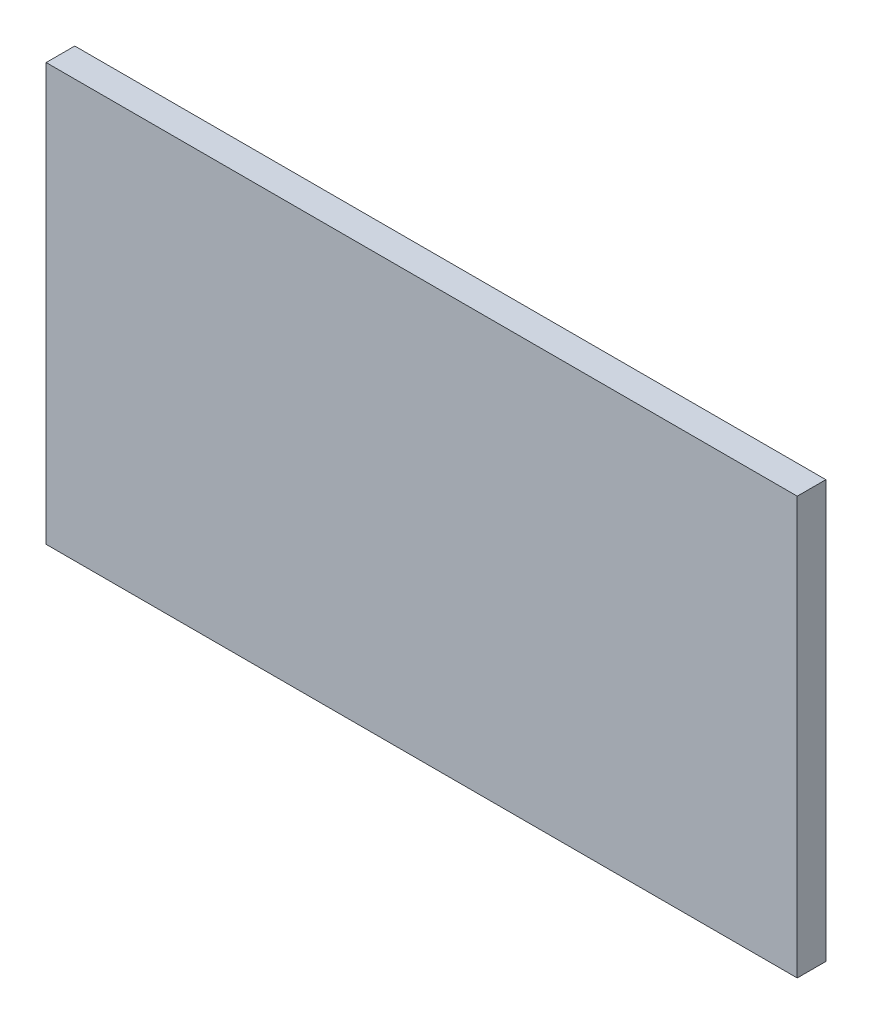
ISO-10303-21;
HEADER;
FILE_DESCRIPTION(('STEP AP214'),'2;1');
FILE_NAME('part.step','',(''),(''),'','','');
FILE_SCHEMA(('AUTOMOTIVE_DESIGN { 1 0 10303 214 1 1 1 1 }'));
ENDSEC;
DATA;
#1=APPLICATION_CONTEXT('core data for automotive mechanical design processes');
#2=APPLICATION_PROTOCOL_DEFINITION('international standard','automotive_design',2000,#1);
#3=PRODUCT_CONTEXT('',#1,'mechanical');
#4=PRODUCT('Part','Part','',(#3));
#5=PRODUCT_RELATED_PRODUCT_CATEGORY('part','',(#4));
#6=PRODUCT_DEFINITION_FORMATION('','',#4);
#7=PRODUCT_DEFINITION_CONTEXT('part definition',#1,'design');
#8=PRODUCT_DEFINITION('design','',#6,#7);
#9=PRODUCT_DEFINITION_SHAPE('','',#8);
#10=(LENGTH_UNIT() NAMED_UNIT(*) SI_UNIT(.MILLI.,.METRE.));
#11=(NAMED_UNIT(*) PLANE_ANGLE_UNIT() SI_UNIT($,.RADIAN.));
#12=(NAMED_UNIT(*) SI_UNIT($,.STERADIAN.) SOLID_ANGLE_UNIT());
#13=UNCERTAINTY_MEASURE_WITH_UNIT(LENGTH_MEASURE(1.E-05),#10,'distance_accuracy_value','');
#14=(GEOMETRIC_REPRESENTATION_CONTEXT(3) GLOBAL_UNCERTAINTY_ASSIGNED_CONTEXT((#13)) GLOBAL_UNIT_ASSIGNED_CONTEXT((#10,
#11,#12)) REPRESENTATION_CONTEXT('',''));
#15=CARTESIAN_POINT('',(0.,0.,0.));
#16=DIRECTION('',(0.,0.,1.));
#17=DIRECTION('',(1.,0.,0.));
#18=AXIS2_PLACEMENT_3D('',#15,#16,#17);
#19=CARTESIAN_POINT('',(12.50008,4.8,0.));
#20=DIRECTION('',(0.,0.,-1.));
#21=DIRECTION('',(-1.,0.,0.));
#22=AXIS2_PLACEMENT_3D('',#19,#20,#21);
#23=PLANE('',#22);
#24=DIRECTION('',(1.,0.,0.));
#25=VECTOR('',#24,1.);
#26=CARTESIAN_POINT('',(12.05008,5.05,0.));
#27=LINE('',#26,#25);
#28=CARTESIAN_POINT('',(12.05008,5.05,0.));
#29=VERTEX_POINT('',#28);
#30=CARTESIAN_POINT('',(12.95008,5.05,0.));
#31=VERTEX_POINT('',#30);
#32=EDGE_CURVE('E55',#29,#31,#27,.T.);
#33=ORIENTED_EDGE('',*,*,#32,.T.);
#34=DIRECTION('',(0.,1.,0.));
#35=VECTOR('',#34,1.);
#36=CARTESIAN_POINT('',(12.95008,5.05,0.));
#37=LINE('',#36,#35);
#38=CARTESIAN_POINT('',(12.95008,4.55,0.));
#39=VERTEX_POINT('',#38);
#40=EDGE_CURVE('E57',#31,#39,#37,.F.);
#41=ORIENTED_EDGE('',*,*,#40,.T.);
#42=DIRECTION('',(1.,0.,0.));
#43=VECTOR('',#42,1.);
#44=CARTESIAN_POINT('',(12.95008,4.55,0.));
#45=LINE('',#44,#43);
#46=CARTESIAN_POINT('',(12.05008,4.55,0.));
#47=VERTEX_POINT('',#46);
#48=EDGE_CURVE('E20',#39,#47,#45,.F.);
#49=ORIENTED_EDGE('',*,*,#48,.T.);
#50=DIRECTION('',(0.,1.,0.));
#51=VECTOR('',#50,1.);
#52=CARTESIAN_POINT('',(12.05008,4.55,0.));
#53=LINE('',#52,#51);
#54=EDGE_CURVE('E80',#47,#29,#53,.T.);
#55=ORIENTED_EDGE('',*,*,#54,.T.);
#56=EDGE_LOOP('',(#33,#41,#49,#55));
#57=FACE_BOUND('',#56,.T.);
#58=ADVANCED_FACE('F17',(#57),#23,.T.);
#59=CARTESIAN_POINT('',(12.95008,4.55,0.));
#60=DIRECTION('',(0.,1.,0.));
#61=DIRECTION('',(0.,0.,1.));
#62=AXIS2_PLACEMENT_3D('',#59,#60,#61);
#63=PLANE('',#62);
#64=DIRECTION('',(0.,0.,-1.));
#65=VECTOR('',#64,1.);
#66=CARTESIAN_POINT('',(12.05008,4.55,0.));
#67=LINE('',#66,#65);
#68=CARTESIAN_POINT('',(12.05008,4.55,0.03429));
#69=VERTEX_POINT('',#68);
#70=EDGE_CURVE('E68',#69,#47,#67,.T.);
#71=ORIENTED_EDGE('',*,*,#70,.T.);
#72=ORIENTED_EDGE('',*,*,#48,.F.);
#73=DIRECTION('',(0.,0.,1.));
#74=VECTOR('',#73,1.);
#75=CARTESIAN_POINT('',(12.95008,4.55,0.));
#76=LINE('',#75,#74);
#77=CARTESIAN_POINT('',(12.95008,4.55,0.03429));
#78=VERTEX_POINT('',#77);
#79=EDGE_CURVE('E63',#39,#78,#76,.T.);
#80=ORIENTED_EDGE('',*,*,#79,.T.);
#81=DIRECTION('',(1.,0.,0.));
#82=VECTOR('',#81,1.);
#83=CARTESIAN_POINT('',(12.50008,4.55,0.03429));
#84=LINE('',#83,#82);
#85=EDGE_CURVE('E83',#69,#78,#84,.T.);
#86=ORIENTED_EDGE('',*,*,#85,.F.);
#87=EDGE_LOOP('',(#71,#72,#80,#86));
#88=FACE_BOUND('',#87,.T.);
#89=ADVANCED_FACE('F65',(#88),#63,.F.);
#90=CARTESIAN_POINT('',(12.95008,5.05,0.));
#91=DIRECTION('',(-1.,0.,0.));
#92=DIRECTION('',(0.,0.,1.));
#93=AXIS2_PLACEMENT_3D('',#90,#91,#92);
#94=PLANE('',#93);
#95=ORIENTED_EDGE('',*,*,#79,.F.);
#96=ORIENTED_EDGE('',*,*,#40,.F.);
#97=DIRECTION('',(0.,0.,-1.));
#98=VECTOR('',#97,1.);
#99=CARTESIAN_POINT('',(12.95008,5.05,0.));
#100=LINE('',#99,#98);
#101=CARTESIAN_POINT('',(12.95008,5.05,0.03429));
#102=VERTEX_POINT('',#101);
#103=EDGE_CURVE('E75',#31,#102,#100,.F.);
#104=ORIENTED_EDGE('',*,*,#103,.T.);
#105=DIRECTION('',(0.,1.,0.));
#106=VECTOR('',#105,1.);
#107=CARTESIAN_POINT('',(12.95008,4.8,0.03429));
#108=LINE('',#107,#106);
#109=EDGE_CURVE('E72',#78,#102,#108,.T.);
#110=ORIENTED_EDGE('',*,*,#109,.F.);
#111=EDGE_LOOP('',(#95,#96,#104,#110));
#112=FACE_BOUND('',#111,.T.);
#113=ADVANCED_FACE('F70',(#112),#94,.F.);
#114=CARTESIAN_POINT('',(12.05008,5.05,0.));
#115=DIRECTION('',(0.,-1.,0.));
#116=DIRECTION('',(0.,0.,-1.));
#117=AXIS2_PLACEMENT_3D('',#114,#115,#116);
#118=PLANE('',#117);
#119=ORIENTED_EDGE('',*,*,#103,.F.);
#120=ORIENTED_EDGE('',*,*,#32,.F.);
#121=DIRECTION('',(0.,0.,-1.));
#122=VECTOR('',#121,1.);
#123=CARTESIAN_POINT('',(12.05008,5.05,0.));
#124=LINE('',#123,#122);
#125=CARTESIAN_POINT('',(12.05008,5.05,0.03429));
#126=VERTEX_POINT('',#125);
#127=EDGE_CURVE('E35',#29,#126,#124,.F.);
#128=ORIENTED_EDGE('',*,*,#127,.T.);
#129=DIRECTION('',(1.,0.,0.));
#130=VECTOR('',#129,1.);
#131=CARTESIAN_POINT('',(12.50008,5.05,0.03429));
#132=LINE('',#131,#130);
#133=EDGE_CURVE('E26',#102,#126,#132,.F.);
#134=ORIENTED_EDGE('',*,*,#133,.F.);
#135=EDGE_LOOP('',(#119,#120,#128,#134));
#136=FACE_BOUND('',#135,.T.);
#137=ADVANCED_FACE('F89',(#136),#118,.F.);
#138=CARTESIAN_POINT('',(12.05008,4.55,0.));
#139=DIRECTION('',(1.,0.,0.));
#140=DIRECTION('',(0.,0.,-1.));
#141=AXIS2_PLACEMENT_3D('',#138,#139,#140);
#142=PLANE('',#141);
#143=ORIENTED_EDGE('',*,*,#127,.F.);
#144=ORIENTED_EDGE('',*,*,#54,.F.);
#145=ORIENTED_EDGE('',*,*,#70,.F.);
#146=DIRECTION('',(0.,1.,0.));
#147=VECTOR('',#146,1.);
#148=CARTESIAN_POINT('',(12.05008,4.8,0.03429));
#149=LINE('',#148,#147);
#150=EDGE_CURVE('E11',#126,#69,#149,.F.);
#151=ORIENTED_EDGE('',*,*,#150,.F.);
#152=EDGE_LOOP('',(#143,#144,#145,#151));
#153=FACE_BOUND('',#152,.T.);
#154=ADVANCED_FACE('F91',(#153),#142,.F.);
#155=CARTESIAN_POINT('',(12.50008,4.8,0.03429));
#156=DIRECTION('',(0.,0.,1.));
#157=DIRECTION('',(1.,0.,0.));
#158=AXIS2_PLACEMENT_3D('',#155,#156,#157);
#159=PLANE('',#158);
#160=ORIENTED_EDGE('',*,*,#133,.T.);
#161=ORIENTED_EDGE('',*,*,#150,.T.);
#162=ORIENTED_EDGE('',*,*,#85,.T.);
#163=ORIENTED_EDGE('',*,*,#109,.T.);
#164=EDGE_LOOP('',(#160,#161,#162,#163));
#165=FACE_BOUND('',#164,.T.);
#166=ADVANCED_FACE('F88',(#165),#159,.T.);
#167=CLOSED_SHELL('',(#58,#89,#113,#137,#154,#166));
#168=MANIFOLD_SOLID_BREP('B1',#167);
#169=ADVANCED_BREP_SHAPE_REPRESENTATION('',(#18,#168),#14);
#170=SHAPE_DEFINITION_REPRESENTATION(#9,#169);
ENDSEC;
END-ISO-10303-21;
